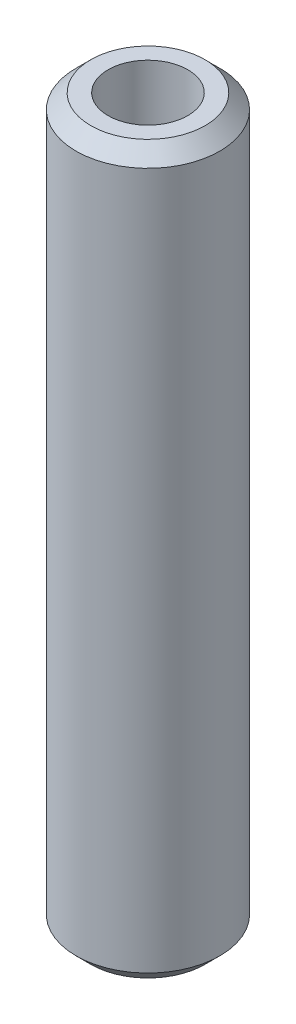
ISO-10303-21;
HEADER;
FILE_DESCRIPTION(('STEP AP214'),'2;1');
FILE_NAME('part.step','',(''),(''),'','','');
FILE_SCHEMA(('AUTOMOTIVE_DESIGN { 1 0 10303 214 1 1 1 1 }'));
ENDSEC;
DATA;
#1=APPLICATION_CONTEXT('core data for automotive mechanical design processes');
#2=APPLICATION_PROTOCOL_DEFINITION('international standard','automotive_design',2000,#1);
#3=PRODUCT_CONTEXT('',#1,'mechanical');
#4=PRODUCT('Part','Part','',(#3));
#5=PRODUCT_RELATED_PRODUCT_CATEGORY('part','',(#4));
#6=PRODUCT_DEFINITION_FORMATION('','',#4);
#7=PRODUCT_DEFINITION_CONTEXT('part definition',#1,'design');
#8=PRODUCT_DEFINITION('design','',#6,#7);
#9=PRODUCT_DEFINITION_SHAPE('','',#8);
#10=(LENGTH_UNIT() NAMED_UNIT(*) SI_UNIT(.MILLI.,.METRE.));
#11=(NAMED_UNIT(*) PLANE_ANGLE_UNIT() SI_UNIT($,.RADIAN.));
#12=(NAMED_UNIT(*) SI_UNIT($,.STERADIAN.) SOLID_ANGLE_UNIT());
#13=UNCERTAINTY_MEASURE_WITH_UNIT(LENGTH_MEASURE(1.E-05),#10,'distance_accuracy_value','');
#14=(GEOMETRIC_REPRESENTATION_CONTEXT(3) GLOBAL_UNCERTAINTY_ASSIGNED_CONTEXT((#13)) GLOBAL_UNIT_ASSIGNED_CONTEXT((#10,
#11,#12)) REPRESENTATION_CONTEXT('',''));
#15=CARTESIAN_POINT('',(0.,0.,0.));
#16=DIRECTION('',(0.,0.,1.));
#17=DIRECTION('',(1.,0.,0.));
#18=AXIS2_PLACEMENT_3D('',#15,#16,#17);
#19=CARTESIAN_POINT('',(0.,176.837730406283,0.));
#20=DIRECTION('',(0.,-1.,0.));
#21=DIRECTION('',(0.,0.,-1.));
#22=AXIS2_PLACEMENT_3D('',#19,#20,#21);
#23=CYLINDRICAL_SURFACE('',#22,17.5);
#24=CARTESIAN_POINT('',(0.,173.25736397184,0.));
#25=DIRECTION('',(0.,1.,0.));
#26=DIRECTION('',(0.,0.,1.));
#27=AXIS2_PLACEMENT_3D('',#24,#25,#26);
#28=CIRCLE('',#27,17.5);
#29=CARTESIAN_POINT('',(0.,173.25736397184,17.5));
#30=VERTEX_POINT('',#29);
#31=EDGE_CURVE('E50',#30,#30,#28,.F.);
#32=ORIENTED_EDGE('',*,*,#31,.T.);
#33=EDGE_LOOP('',(#32));
#34=FACE_BOUND('',#33,.T.);
#35=CARTESIAN_POINT('',(0.,3.58036643444318,0.));
#36=DIRECTION('',(0.,1.,0.));
#37=DIRECTION('',(0.,0.,1.));
#38=AXIS2_PLACEMENT_3D('',#35,#36,#37);
#39=CIRCLE('',#38,17.5);
#40=CARTESIAN_POINT('',(0.,3.58036643444318,17.5));
#41=VERTEX_POINT('',#40);
#42=EDGE_CURVE('E51',#41,#41,#39,.T.);
#43=ORIENTED_EDGE('',*,*,#42,.T.);
#44=EDGE_LOOP('',(#43));
#45=FACE_BOUND('',#44,.T.);
#46=ADVANCED_FACE('F39',(#34,#45),#23,.T.);
#47=CARTESIAN_POINT('',(0.,176.837730406283,0.));
#48=DIRECTION('',(0.,1.,0.));
#49=DIRECTION('',(0.,0.,1.));
#50=AXIS2_PLACEMENT_3D('',#47,#48,#49);
#51=PLANE('',#50);
#52=CARTESIAN_POINT('',(0.,176.837730406283,0.));
#53=DIRECTION('',(0.,1.,0.));
#54=DIRECTION('',(0.,0.,1.));
#55=AXIS2_PLACEMENT_3D('',#52,#53,#54);
#56=CIRCLE('',#55,13.9196335655568);
#57=CARTESIAN_POINT('',(0.,176.837730406283,13.9196335655568));
#58=VERTEX_POINT('',#57);
#59=EDGE_CURVE('E54',#58,#58,#56,.T.);
#60=ORIENTED_EDGE('',*,*,#59,.T.);
#61=EDGE_LOOP('',(#60));
#62=FACE_BOUND('',#61,.T.);
#63=CARTESIAN_POINT('',(0.,176.837730406283,0.));
#64=DIRECTION('',(0.,1.,0.));
#65=DIRECTION('',(0.,0.,1.));
#66=AXIS2_PLACEMENT_3D('',#63,#64,#65);
#67=CIRCLE('',#66,9.69769477288163);
#68=CARTESIAN_POINT('',(0.,176.837730406283,9.69769477288163));
#69=VERTEX_POINT('',#68);
#70=EDGE_CURVE('E58',#69,#69,#67,.T.);
#71=ORIENTED_EDGE('',*,*,#70,.F.);
#72=EDGE_LOOP('',(#71));
#73=FACE_BOUND('',#72,.T.);
#74=ADVANCED_FACE('F69',(#62,#73),#51,.T.);
#75=CARTESIAN_POINT('',(0.,0.,0.));
#76=DIRECTION('',(0.,1.,0.));
#77=DIRECTION('',(0.,0.,1.));
#78=AXIS2_PLACEMENT_3D('',#75,#76,#77);
#79=PLANE('',#78);
#80=CARTESIAN_POINT('',(0.,0.,0.));
#81=DIRECTION('',(0.,1.,0.));
#82=DIRECTION('',(0.,0.,1.));
#83=AXIS2_PLACEMENT_3D('',#80,#81,#82);
#84=CIRCLE('',#83,13.9196335655568);
#85=CARTESIAN_POINT('',(0.,0.,13.9196335655568));
#86=VERTEX_POINT('',#85);
#87=EDGE_CURVE('E10',#86,#86,#84,.F.);
#88=ORIENTED_EDGE('',*,*,#87,.T.);
#89=EDGE_LOOP('',(#88));
#90=FACE_BOUND('',#89,.T.);
#91=CARTESIAN_POINT('',(0.,0.,0.));
#92=DIRECTION('',(0.,1.,0.));
#93=DIRECTION('',(0.,0.,1.));
#94=AXIS2_PLACEMENT_3D('',#91,#92,#93);
#95=CIRCLE('',#94,9.69769477288163);
#96=CARTESIAN_POINT('',(0.,0.,9.69769477288163));
#97=VERTEX_POINT('',#96);
#98=EDGE_CURVE('E63',#97,#97,#95,.T.);
#99=ORIENTED_EDGE('',*,*,#98,.T.);
#100=EDGE_LOOP('',(#99));
#101=FACE_BOUND('',#100,.T.);
#102=ADVANCED_FACE('F75',(#90,#101),#79,.F.);
#103=CARTESIAN_POINT('',(0.,176.837730406283,0.));
#104=DIRECTION('',(0.,-1.,0.));
#105=DIRECTION('',(0.,0.,-1.));
#106=AXIS2_PLACEMENT_3D('',#103,#104,#105);
#107=CYLINDRICAL_SURFACE('',#106,9.69769477288163);
#108=ORIENTED_EDGE('',*,*,#70,.T.);
#109=EDGE_LOOP('',(#108));
#110=FACE_BOUND('',#109,.T.);
#111=ORIENTED_EDGE('',*,*,#98,.F.);
#112=EDGE_LOOP('',(#111));
#113=FACE_BOUND('',#112,.T.);
#114=ADVANCED_FACE('F70',(#110,#113),#107,.F.);
#115=CARTESIAN_POINT('',(0.,176.837730406283,0.));
#116=DIRECTION('',(0.,-1.,0.));
#117=DIRECTION('',(0.,0.,-1.));
#118=AXIS2_PLACEMENT_3D('',#115,#116,#117);
#119=CONICAL_SURFACE('',#118,13.9196335655568,0.785398163397443);
#120=ORIENTED_EDGE('',*,*,#31,.F.);
#121=EDGE_LOOP('',(#120));
#122=FACE_BOUND('',#121,.T.);
#123=ORIENTED_EDGE('',*,*,#59,.F.);
#124=EDGE_LOOP('',(#123));
#125=FACE_BOUND('',#124,.T.);
#126=ADVANCED_FACE('F81',(#122,#125),#119,.T.);
#127=CARTESIAN_POINT('',(0.,3.58036643444318,0.));
#128=DIRECTION('',(0.,1.,0.));
#129=DIRECTION('',(0.,0.,1.));
#130=AXIS2_PLACEMENT_3D('',#127,#128,#129);
#131=CONICAL_SURFACE('',#130,17.5,0.785398163397447);
#132=ORIENTED_EDGE('',*,*,#87,.F.);
#133=EDGE_LOOP('',(#132));
#134=FACE_BOUND('',#133,.T.);
#135=ORIENTED_EDGE('',*,*,#42,.F.);
#136=EDGE_LOOP('',(#135));
#137=FACE_BOUND('',#136,.T.);
#138=ADVANCED_FACE('F45',(#134,#137),#131,.T.);
#139=CLOSED_SHELL('',(#46,#74,#102,#114,#126,#138));
#140=MANIFOLD_SOLID_BREP('B2',#139);
#141=ADVANCED_BREP_SHAPE_REPRESENTATION('',(#18,#140),#14);
#142=SHAPE_DEFINITION_REPRESENTATION(#9,#141);
ENDSEC;
END-ISO-10303-21;
